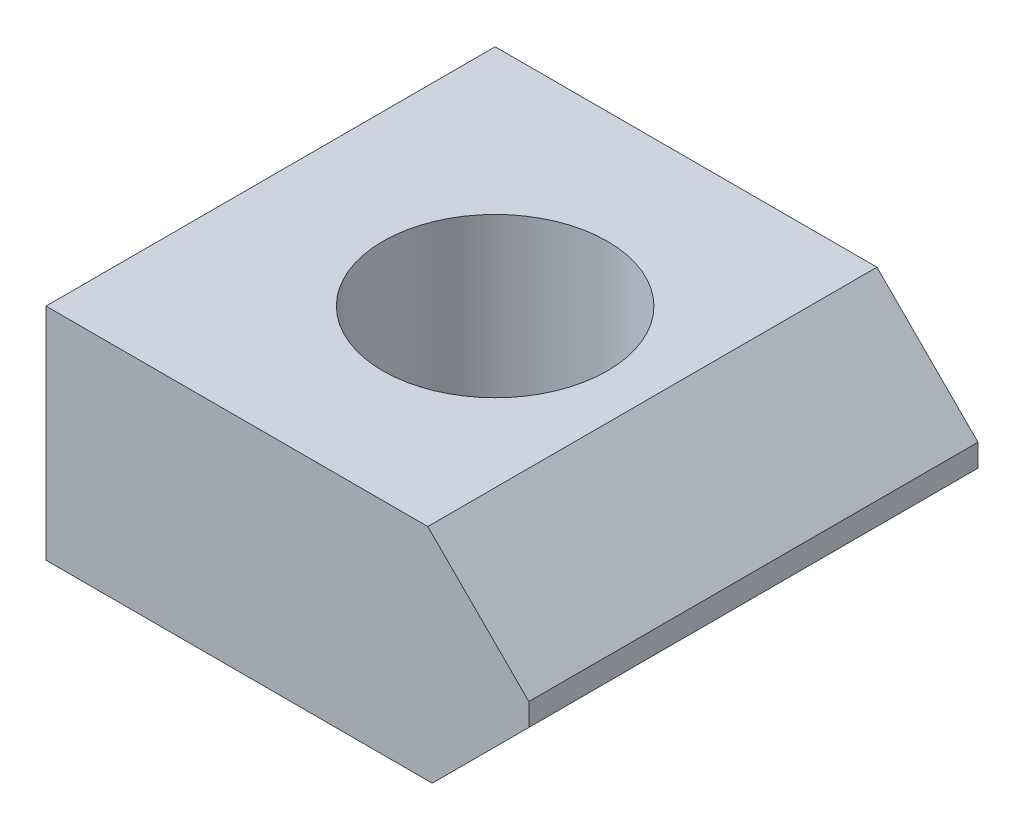
ISO-10303-21;
HEADER;
FILE_DESCRIPTION(('STEP AP214'),'2;1');
FILE_NAME('part.step','',(''),(''),'','','');
FILE_SCHEMA(('AUTOMOTIVE_DESIGN { 1 0 10303 214 1 1 1 1 }'));
ENDSEC;
DATA;
#1=APPLICATION_CONTEXT('core data for automotive mechanical design processes');
#2=APPLICATION_PROTOCOL_DEFINITION('international standard','automotive_design',2000,#1);
#3=PRODUCT_CONTEXT('',#1,'mechanical');
#4=PRODUCT('Part','Part','',(#3));
#5=PRODUCT_RELATED_PRODUCT_CATEGORY('part','',(#4));
#6=PRODUCT_DEFINITION_FORMATION('','',#4);
#7=PRODUCT_DEFINITION_CONTEXT('part definition',#1,'design');
#8=PRODUCT_DEFINITION('design','',#6,#7);
#9=PRODUCT_DEFINITION_SHAPE('','',#8);
#10=(LENGTH_UNIT() NAMED_UNIT(*) SI_UNIT(.MILLI.,.METRE.));
#11=(NAMED_UNIT(*) PLANE_ANGLE_UNIT() SI_UNIT($,.RADIAN.));
#12=(NAMED_UNIT(*) SI_UNIT($,.STERADIAN.) SOLID_ANGLE_UNIT());
#13=UNCERTAINTY_MEASURE_WITH_UNIT(LENGTH_MEASURE(1.E-05),#10,'distance_accuracy_value','');
#14=(GEOMETRIC_REPRESENTATION_CONTEXT(3) GLOBAL_UNCERTAINTY_ASSIGNED_CONTEXT((#13)) GLOBAL_UNIT_ASSIGNED_CONTEXT((#10,
#11,#12)) REPRESENTATION_CONTEXT('',''));
#15=CARTESIAN_POINT('',(0.,0.,0.));
#16=DIRECTION('',(0.,0.,1.));
#17=DIRECTION('',(1.,0.,0.));
#18=AXIS2_PLACEMENT_3D('',#15,#16,#17);
#19=CARTESIAN_POINT('',(17.,15.5,0.));
#20=DIRECTION('',(0.707106781186548,0.707106781186548,0.));
#21=DIRECTION('',(-0.707106781186548,0.707106781186548,0.));
#22=AXIS2_PLACEMENT_3D('',#19,#20,#21);
#23=PLANE('',#22);
#24=DIRECTION('',(0.,0.,-1.));
#25=VECTOR('',#24,1.);
#26=CARTESIAN_POINT('',(21.5,11.,20.));
#27=LINE('',#26,#25);
#28=CARTESIAN_POINT('',(21.5,11.,-20.));
#29=VERTEX_POINT('',#28);
#30=CARTESIAN_POINT('',(21.5,11.,20.));
#31=VERTEX_POINT('',#30);
#32=EDGE_CURVE('E73',#29,#31,#27,.F.);
#33=ORIENTED_EDGE('',*,*,#32,.F.);
#34=DIRECTION('',(0.707106781186547,-0.707106781186547,0.));
#35=VECTOR('',#34,1.);
#36=CARTESIAN_POINT('',(12.5,20.,-20.));
#37=LINE('',#36,#35);
#38=CARTESIAN_POINT('',(12.5,20.,-20.));
#39=VERTEX_POINT('',#38);
#40=EDGE_CURVE('E104',#39,#29,#37,.T.);
#41=ORIENTED_EDGE('',*,*,#40,.F.);
#42=DIRECTION('',(0.,0.,1.));
#43=VECTOR('',#42,1.);
#44=CARTESIAN_POINT('',(12.5,20.,0.));
#45=LINE('',#44,#43);
#46=CARTESIAN_POINT('',(12.5,20.,20.));
#47=VERTEX_POINT('',#46);
#48=EDGE_CURVE('E81',#47,#39,#45,.F.);
#49=ORIENTED_EDGE('',*,*,#48,.F.);
#50=DIRECTION('',(-0.707106781186547,0.707106781186547,0.));
#51=VECTOR('',#50,1.);
#52=CARTESIAN_POINT('',(21.5,11.,20.));
#53=LINE('',#52,#51);
#54=EDGE_CURVE('E66',#31,#47,#53,.T.);
#55=ORIENTED_EDGE('',*,*,#54,.F.);
#56=EDGE_LOOP('',(#33,#41,#49,#55));
#57=FACE_BOUND('',#56,.T.);
#58=ADVANCED_FACE('F17',(#57),#23,.T.);
#59=CARTESIAN_POINT('',(21.5,0.,20.));
#60=DIRECTION('',(1.,0.,0.));
#61=DIRECTION('',(0.,0.,-1.));
#62=AXIS2_PLACEMENT_3D('',#59,#60,#61);
#63=PLANE('',#62);
#64=DIRECTION('',(0.,1.,0.));
#65=VECTOR('',#64,1.);
#66=CARTESIAN_POINT('',(21.5,0.,-20.));
#67=LINE('',#66,#65);
#68=CARTESIAN_POINT('',(21.5,9.,-20.));
#69=VERTEX_POINT('',#68);
#70=EDGE_CURVE('E78',#29,#69,#67,.F.);
#71=ORIENTED_EDGE('',*,*,#70,.F.);
#72=ORIENTED_EDGE('',*,*,#32,.T.);
#73=DIRECTION('',(0.,1.,0.));
#74=VECTOR('',#73,1.);
#75=CARTESIAN_POINT('',(21.5,0.,20.));
#76=LINE('',#75,#74);
#77=CARTESIAN_POINT('',(21.5,9.,20.));
#78=VERTEX_POINT('',#77);
#79=EDGE_CURVE('E76',#78,#31,#76,.T.);
#80=ORIENTED_EDGE('',*,*,#79,.F.);
#81=DIRECTION('',(0.,0.,1.));
#82=VECTOR('',#81,1.);
#83=CARTESIAN_POINT('',(21.5,9.,0.));
#84=LINE('',#83,#82);
#85=EDGE_CURVE('E114',#69,#78,#84,.T.);
#86=ORIENTED_EDGE('',*,*,#85,.F.);
#87=EDGE_LOOP('',(#71,#72,#80,#86));
#88=FACE_BOUND('',#87,.T.);
#89=ADVANCED_FACE('F74',(#88),#63,.T.);
#90=CARTESIAN_POINT('',(0.,20.,0.));
#91=DIRECTION('',(0.,1.,0.));
#92=DIRECTION('',(0.,0.,1.));
#93=AXIS2_PLACEMENT_3D('',#90,#91,#92);
#94=PLANE('',#93);
#95=CARTESIAN_POINT('',(-1.5,20.,0.));
#96=DIRECTION('',(0.,1.,0.));
#97=DIRECTION('',(0.,0.,1.));
#98=AXIS2_PLACEMENT_3D('',#95,#96,#97);
#99=CIRCLE('',#98,10.);
#100=CARTESIAN_POINT('',(-1.5,20.,10.));
#101=VERTEX_POINT('',#100);
#102=EDGE_CURVE('E20',#101,#101,#99,.F.);
#103=ORIENTED_EDGE('',*,*,#102,.T.);
#104=EDGE_LOOP('',(#103));
#105=FACE_BOUND('',#104,.T.);
#106=DIRECTION('',(1.,0.,0.));
#107=VECTOR('',#106,1.);
#108=CARTESIAN_POINT('',(-21.5,20.,20.));
#109=LINE('',#108,#107);
#110=CARTESIAN_POINT('',(-21.5,20.,20.));
#111=VERTEX_POINT('',#110);
#112=EDGE_CURVE('E89',#47,#111,#109,.F.);
#113=ORIENTED_EDGE('',*,*,#112,.F.);
#114=ORIENTED_EDGE('',*,*,#48,.T.);
#115=DIRECTION('',(-1.,0.,0.));
#116=VECTOR('',#115,1.);
#117=CARTESIAN_POINT('',(21.5,20.,-20.));
#118=LINE('',#117,#116);
#119=CARTESIAN_POINT('',(-21.5,20.,-20.));
#120=VERTEX_POINT('',#119);
#121=EDGE_CURVE('E101',#120,#39,#118,.F.);
#122=ORIENTED_EDGE('',*,*,#121,.F.);
#123=DIRECTION('',(0.,0.,1.));
#124=VECTOR('',#123,1.);
#125=CARTESIAN_POINT('',(-21.5,20.,-20.));
#126=LINE('',#125,#124);
#127=EDGE_CURVE('E86',#111,#120,#126,.F.);
#128=ORIENTED_EDGE('',*,*,#127,.F.);
#129=EDGE_LOOP('',(#113,#114,#122,#128));
#130=FACE_BOUND('',#129,.T.);
#131=ADVANCED_FACE('F99',(#105,#130),#94,.T.);
#132=CARTESIAN_POINT('',(-21.5,0.,-20.));
#133=DIRECTION('',(-1.,0.,0.));
#134=DIRECTION('',(0.,0.,1.));
#135=AXIS2_PLACEMENT_3D('',#132,#133,#134);
#136=PLANE('',#135);
#137=DIRECTION('',(0.,1.,0.));
#138=VECTOR('',#137,1.);
#139=CARTESIAN_POINT('',(-21.5,0.,-20.));
#140=LINE('',#139,#138);
#141=CARTESIAN_POINT('',(-21.5,0.4,-20.));
#142=VERTEX_POINT('',#141);
#143=EDGE_CURVE('E106',#142,#120,#140,.T.);
#144=ORIENTED_EDGE('',*,*,#143,.F.);
#145=DIRECTION('',(0.,0.,1.));
#146=VECTOR('',#145,1.);
#147=CARTESIAN_POINT('',(-21.5,0.4,20.));
#148=LINE('',#147,#146);
#149=CARTESIAN_POINT('',(-21.5,0.4,20.));
#150=VERTEX_POINT('',#149);
#151=EDGE_CURVE('E123',#142,#150,#148,.T.);
#152=ORIENTED_EDGE('',*,*,#151,.T.);
#153=DIRECTION('',(0.,1.,0.));
#154=VECTOR('',#153,1.);
#155=CARTESIAN_POINT('',(-21.5,0.,20.));
#156=LINE('',#155,#154);
#157=EDGE_CURVE('E91',#111,#150,#156,.F.);
#158=ORIENTED_EDGE('',*,*,#157,.F.);
#159=ORIENTED_EDGE('',*,*,#127,.T.);
#160=EDGE_LOOP('',(#144,#152,#158,#159));
#161=FACE_BOUND('',#160,.T.);
#162=ADVANCED_FACE('F127',(#161),#136,.T.);
#163=CARTESIAN_POINT('',(-21.5,0.,20.));
#164=DIRECTION('',(0.,0.,1.));
#165=DIRECTION('',(1.,0.,0.));
#166=AXIS2_PLACEMENT_3D('',#163,#164,#165);
#167=PLANE('',#166);
#168=ORIENTED_EDGE('',*,*,#157,.T.);
#169=DIRECTION('',(1.,0.,0.));
#170=VECTOR('',#169,1.);
#171=CARTESIAN_POINT('',(250.863011818,0.4,20.));
#172=LINE('',#171,#170);
#173=CARTESIAN_POINT('',(12.9,0.4,20.));
#174=VERTEX_POINT('',#173);
#175=EDGE_CURVE('E117',#150,#174,#172,.T.);
#176=ORIENTED_EDGE('',*,*,#175,.T.);
#177=DIRECTION('',(0.707106781186548,0.707106781186548,0.));
#178=VECTOR('',#177,1.);
#179=CARTESIAN_POINT('',(17.,4.5,20.));
#180=LINE('',#179,#178);
#181=EDGE_CURVE('E85',#78,#174,#180,.F.);
#182=ORIENTED_EDGE('',*,*,#181,.F.);
#183=ORIENTED_EDGE('',*,*,#79,.T.);
#184=ORIENTED_EDGE('',*,*,#54,.T.);
#185=ORIENTED_EDGE('',*,*,#112,.T.);
#186=EDGE_LOOP('',(#168,#176,#182,#183,#184,#185));
#187=FACE_BOUND('',#186,.T.);
#188=ADVANCED_FACE('F83',(#187),#167,.T.);
#189=CARTESIAN_POINT('',(17.,4.5,0.));
#190=DIRECTION('',(0.707106781186548,-0.707106781186548,0.));
#191=DIRECTION('',(0.707106781186548,0.707106781186548,0.));
#192=AXIS2_PLACEMENT_3D('',#189,#190,#191);
#193=PLANE('',#192);
#194=ORIENTED_EDGE('',*,*,#181,.T.);
#195=DIRECTION('',(0.,0.,1.));
#196=VECTOR('',#195,1.);
#197=CARTESIAN_POINT('',(12.9,0.4,20.));
#198=LINE('',#197,#196);
#199=CARTESIAN_POINT('',(12.9,0.4,-20.));
#200=VERTEX_POINT('',#199);
#201=EDGE_CURVE('E125',#174,#200,#198,.F.);
#202=ORIENTED_EDGE('',*,*,#201,.T.);
#203=DIRECTION('',(-0.707106781186548,-0.707106781186548,0.));
#204=VECTOR('',#203,1.);
#205=CARTESIAN_POINT('',(21.5,9.,-20.));
#206=LINE('',#205,#204);
#207=EDGE_CURVE('E34',#69,#200,#206,.T.);
#208=ORIENTED_EDGE('',*,*,#207,.F.);
#209=ORIENTED_EDGE('',*,*,#85,.T.);
#210=EDGE_LOOP('',(#194,#202,#208,#209));
#211=FACE_BOUND('',#210,.T.);
#212=ADVANCED_FACE('F133',(#211),#193,.T.);
#213=CARTESIAN_POINT('',(21.5,0.,-20.));
#214=DIRECTION('',(0.,0.,-1.));
#215=DIRECTION('',(-1.,0.,0.));
#216=AXIS2_PLACEMENT_3D('',#213,#214,#215);
#217=PLANE('',#216);
#218=ORIENTED_EDGE('',*,*,#207,.T.);
#219=DIRECTION('',(1.,0.,0.));
#220=VECTOR('',#219,1.);
#221=CARTESIAN_POINT('',(250.863011818,0.4,-20.));
#222=LINE('',#221,#220);
#223=EDGE_CURVE('E26',#200,#142,#222,.F.);
#224=ORIENTED_EDGE('',*,*,#223,.T.);
#225=ORIENTED_EDGE('',*,*,#143,.T.);
#226=ORIENTED_EDGE('',*,*,#121,.T.);
#227=ORIENTED_EDGE('',*,*,#40,.T.);
#228=ORIENTED_EDGE('',*,*,#70,.T.);
#229=EDGE_LOOP('',(#218,#224,#225,#226,#227,#228));
#230=FACE_BOUND('',#229,.T.);
#231=ADVANCED_FACE('F103',(#230),#217,.T.);
#232=CARTESIAN_POINT('',(-1.5,20.,0.));
#233=DIRECTION('',(0.,1.,0.));
#234=DIRECTION('',(0.,0.,1.));
#235=AXIS2_PLACEMENT_3D('',#232,#233,#234);
#236=CYLINDRICAL_SURFACE('',#235,10.);
#237=ORIENTED_EDGE('',*,*,#102,.F.);
#238=EDGE_LOOP('',(#237));
#239=FACE_BOUND('',#238,.T.);
#240=CARTESIAN_POINT('',(-1.5,0.400000000000001,0.));
#241=DIRECTION('',(0.,1.,0.));
#242=DIRECTION('',(0.,0.,1.));
#243=AXIS2_PLACEMENT_3D('',#240,#241,#242);
#244=CIRCLE('',#243,10.);
#245=CARTESIAN_POINT('',(-1.5,0.400000000000001,10.));
#246=VERTEX_POINT('',#245);
#247=EDGE_CURVE('E11',#246,#246,#244,.F.);
#248=ORIENTED_EDGE('',*,*,#247,.T.);
#249=EDGE_LOOP('',(#248));
#250=FACE_BOUND('',#249,.T.);
#251=ADVANCED_FACE('F141',(#239,#250),#236,.F.);
#252=CARTESIAN_POINT('',(250.863011818,0.4,20.));
#253=DIRECTION('',(0.,1.,0.));
#254=DIRECTION('',(0.,0.,1.));
#255=AXIS2_PLACEMENT_3D('',#252,#253,#254);
#256=PLANE('',#255);
#257=ORIENTED_EDGE('',*,*,#247,.F.);
#258=EDGE_LOOP('',(#257));
#259=FACE_BOUND('',#258,.T.);
#260=ORIENTED_EDGE('',*,*,#201,.F.);
#261=ORIENTED_EDGE('',*,*,#175,.F.);
#262=ORIENTED_EDGE('',*,*,#151,.F.);
#263=ORIENTED_EDGE('',*,*,#223,.F.);
#264=EDGE_LOOP('',(#260,#261,#262,#263));
#265=FACE_BOUND('',#264,.T.);
#266=ADVANCED_FACE('F122',(#259,#265),#256,.F.);
#267=CLOSED_SHELL('',(#58,#89,#131,#162,#188,#212,#231,#251,#266));
#268=MANIFOLD_SOLID_BREP('B1',#267);
#269=ADVANCED_BREP_SHAPE_REPRESENTATION('',(#18,#268),#14);
#270=SHAPE_DEFINITION_REPRESENTATION(#9,#269);
ENDSEC;
END-ISO-10303-21;
